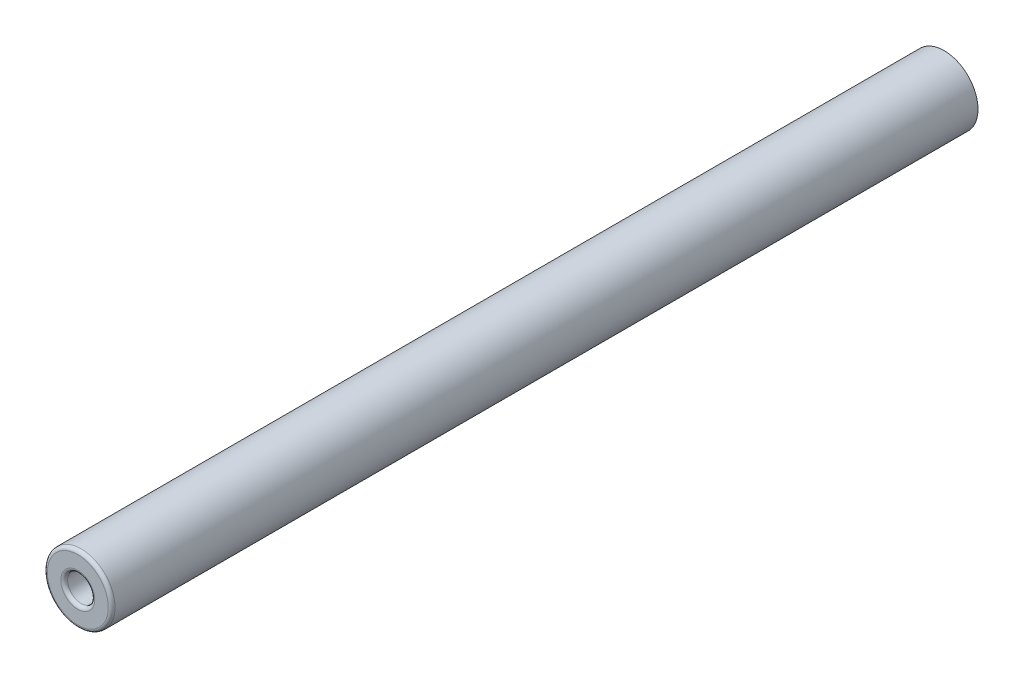
ISO-10303-21;
HEADER;
FILE_DESCRIPTION(('STEP AP214'),'2;1');
FILE_NAME('part.step','',(''),(''),'','','');
FILE_SCHEMA(('AUTOMOTIVE_DESIGN { 1 0 10303 214 1 1 1 1 }'));
ENDSEC;
DATA;
#1=APPLICATION_CONTEXT('core data for automotive mechanical design processes');
#2=APPLICATION_PROTOCOL_DEFINITION('international standard','automotive_design',2000,#1);
#3=PRODUCT_CONTEXT('',#1,'mechanical');
#4=PRODUCT('Part','Part','',(#3));
#5=PRODUCT_RELATED_PRODUCT_CATEGORY('part','',(#4));
#6=PRODUCT_DEFINITION_FORMATION('','',#4);
#7=PRODUCT_DEFINITION_CONTEXT('part definition',#1,'design');
#8=PRODUCT_DEFINITION('design','',#6,#7);
#9=PRODUCT_DEFINITION_SHAPE('','',#8);
#10=(LENGTH_UNIT() NAMED_UNIT(*) SI_UNIT(.MILLI.,.METRE.));
#11=(NAMED_UNIT(*) PLANE_ANGLE_UNIT() SI_UNIT($,.RADIAN.));
#12=(NAMED_UNIT(*) SI_UNIT($,.STERADIAN.) SOLID_ANGLE_UNIT());
#13=UNCERTAINTY_MEASURE_WITH_UNIT(LENGTH_MEASURE(1.E-05),#10,'distance_accuracy_value','');
#14=(GEOMETRIC_REPRESENTATION_CONTEXT(3) GLOBAL_UNCERTAINTY_ASSIGNED_CONTEXT((#13)) GLOBAL_UNIT_ASSIGNED_CONTEXT((#10,
#11,#12)) REPRESENTATION_CONTEXT('',''));
#15=CARTESIAN_POINT('',(0.,0.,0.));
#16=DIRECTION('',(0.,0.,1.));
#17=DIRECTION('',(1.,0.,0.));
#18=AXIS2_PLACEMENT_3D('',#15,#16,#17);
#19=CARTESIAN_POINT('',(0.,0.,64.));
#20=DIRECTION('',(0.,0.,-1.));
#21=DIRECTION('',(-1.,0.,0.));
#22=AXIS2_PLACEMENT_3D('',#19,#20,#21);
#23=CYLINDRICAL_SURFACE('',#22,2.5);
#24=CARTESIAN_POINT('',(0.,0.,63.75));
#25=DIRECTION('',(0.,0.,1.));
#26=DIRECTION('',(1.,0.,0.));
#27=AXIS2_PLACEMENT_3D('',#24,#25,#26);
#28=CIRCLE('',#27,2.5);
#29=CARTESIAN_POINT('',(2.5,0.,63.75));
#30=VERTEX_POINT('',#29);
#31=EDGE_CURVE('E38',#30,#30,#28,.F.);
#32=ORIENTED_EDGE('',*,*,#31,.T.);
#33=EDGE_LOOP('',(#32));
#34=FACE_BOUND('',#33,.T.);
#35=CARTESIAN_POINT('',(0.,0.,0.));
#36=DIRECTION('',(0.,0.,1.));
#37=DIRECTION('',(1.,0.,0.));
#38=AXIS2_PLACEMENT_3D('',#35,#36,#37);
#39=CIRCLE('',#38,2.5);
#40=CARTESIAN_POINT('',(2.5,0.,0.));
#41=VERTEX_POINT('',#40);
#42=EDGE_CURVE('E51',#41,#41,#39,.T.);
#43=ORIENTED_EDGE('',*,*,#42,.T.);
#44=EDGE_LOOP('',(#43));
#45=FACE_BOUND('',#44,.T.);
#46=ADVANCED_FACE('F31',(#34,#45),#23,.T.);
#47=CARTESIAN_POINT('',(0.,0.,64.));
#48=DIRECTION('',(0.,0.,1.));
#49=DIRECTION('',(1.,0.,0.));
#50=AXIS2_PLACEMENT_3D('',#47,#48,#49);
#51=PLANE('',#50);
#52=CARTESIAN_POINT('',(0.,0.,64.));
#53=DIRECTION('',(0.,0.,1.));
#54=DIRECTION('',(1.,0.,0.));
#55=AXIS2_PLACEMENT_3D('',#52,#53,#54);
#56=CIRCLE('',#55,2.25);
#57=CARTESIAN_POINT('',(2.25,0.,64.));
#58=VERTEX_POINT('',#57);
#59=EDGE_CURVE('E42',#58,#58,#56,.T.);
#60=ORIENTED_EDGE('',*,*,#59,.T.);
#61=EDGE_LOOP('',(#60));
#62=FACE_BOUND('',#61,.T.);
#63=CARTESIAN_POINT('',(0.,0.,64.));
#64=DIRECTION('',(0.,0.,1.));
#65=DIRECTION('',(1.,0.,0.));
#66=AXIS2_PLACEMENT_3D('',#63,#64,#65);
#67=CIRCLE('',#66,1.25);
#68=CARTESIAN_POINT('',(1.25,0.,64.));
#69=VERTEX_POINT('',#68);
#70=EDGE_CURVE('E46',#69,#69,#67,.F.);
#71=ORIENTED_EDGE('',*,*,#70,.T.);
#72=EDGE_LOOP('',(#71));
#73=FACE_BOUND('',#72,.T.);
#74=ADVANCED_FACE('F70',(#62,#73),#51,.T.);
#75=CARTESIAN_POINT('',(0.,0.,0.));
#76=DIRECTION('',(0.,0.,1.));
#77=DIRECTION('',(1.,0.,0.));
#78=AXIS2_PLACEMENT_3D('',#75,#76,#77);
#79=PLANE('',#78);
#80=ORIENTED_EDGE('',*,*,#42,.F.);
#81=EDGE_LOOP('',(#80));
#82=FACE_BOUND('',#81,.T.);
#83=ADVANCED_FACE('F62',(#82),#79,.F.);
#84=CARTESIAN_POINT('',(0.,0.,54.));
#85=DIRECTION('',(0.,0.,1.));
#86=DIRECTION('',(1.,0.,0.));
#87=AXIS2_PLACEMENT_3D('',#84,#85,#86);
#88=CYLINDRICAL_SURFACE('',#87,1.);
#89=CARTESIAN_POINT('',(0.,0.,63.75));
#90=DIRECTION('',(0.,0.,1.));
#91=DIRECTION('',(1.,0.,0.));
#92=AXIS2_PLACEMENT_3D('',#89,#90,#91);
#93=CIRCLE('',#92,1.);
#94=CARTESIAN_POINT('',(1.,0.,63.75));
#95=VERTEX_POINT('',#94);
#96=EDGE_CURVE('E10',#95,#95,#93,.T.);
#97=ORIENTED_EDGE('',*,*,#96,.T.);
#98=EDGE_LOOP('',(#97));
#99=FACE_BOUND('',#98,.T.);
#100=CARTESIAN_POINT('',(0.,0.,54.));
#101=DIRECTION('',(0.,0.,1.));
#102=DIRECTION('',(1.,0.,0.));
#103=AXIS2_PLACEMENT_3D('',#100,#101,#102);
#104=CIRCLE('',#103,1.);
#105=CARTESIAN_POINT('',(1.,0.,54.));
#106=VERTEX_POINT('',#105);
#107=EDGE_CURVE('E54',#106,#106,#104,.T.);
#108=ORIENTED_EDGE('',*,*,#107,.F.);
#109=EDGE_LOOP('',(#108));
#110=FACE_BOUND('',#109,.T.);
#111=ADVANCED_FACE('F60',(#99,#110),#88,.F.);
#112=CARTESIAN_POINT('',(0.,0.,54.));
#113=DIRECTION('',(0.,0.,1.));
#114=DIRECTION('',(1.,0.,0.));
#115=AXIS2_PLACEMENT_3D('',#112,#113,#114);
#116=PLANE('',#115);
#117=ORIENTED_EDGE('',*,*,#107,.T.);
#118=EDGE_LOOP('',(#117));
#119=FACE_BOUND('',#118,.T.);
#120=ADVANCED_FACE('F58',(#119),#116,.T.);
#121=CARTESIAN_POINT('',(0.,0.,63.75));
#122=DIRECTION('',(0.,0.,1.));
#123=DIRECTION('',(1.,0.,0.));
#124=AXIS2_PLACEMENT_3D('',#121,#122,#123);
#125=TOROIDAL_SURFACE('',#124,2.25,0.25);
#126=ORIENTED_EDGE('',*,*,#31,.F.);
#127=EDGE_LOOP('',(#126));
#128=FACE_BOUND('',#127,.T.);
#129=ORIENTED_EDGE('',*,*,#59,.F.);
#130=EDGE_LOOP('',(#129));
#131=FACE_BOUND('',#130,.T.);
#132=ADVANCED_FACE('F68',(#128,#131),#125,.T.);
#133=CARTESIAN_POINT('',(0.,0.,63.75));
#134=DIRECTION('',(0.,0.,1.));
#135=DIRECTION('',(1.,0.,0.));
#136=AXIS2_PLACEMENT_3D('',#133,#134,#135);
#137=TOROIDAL_SURFACE('',#136,1.25,0.25);
#138=ORIENTED_EDGE('',*,*,#70,.F.);
#139=EDGE_LOOP('',(#138));
#140=FACE_BOUND('',#139,.T.);
#141=ORIENTED_EDGE('',*,*,#96,.F.);
#142=EDGE_LOOP('',(#141));
#143=FACE_BOUND('',#142,.T.);
#144=ADVANCED_FACE('F33',(#140,#143),#137,.T.);
#145=CLOSED_SHELL('',(#46,#74,#83,#111,#120,#132,#144));
#146=MANIFOLD_SOLID_BREP('B2',#145);
#147=ADVANCED_BREP_SHAPE_REPRESENTATION('',(#18,#146),#14);
#148=SHAPE_DEFINITION_REPRESENTATION(#9,#147);
ENDSEC;
END-ISO-10303-21;
